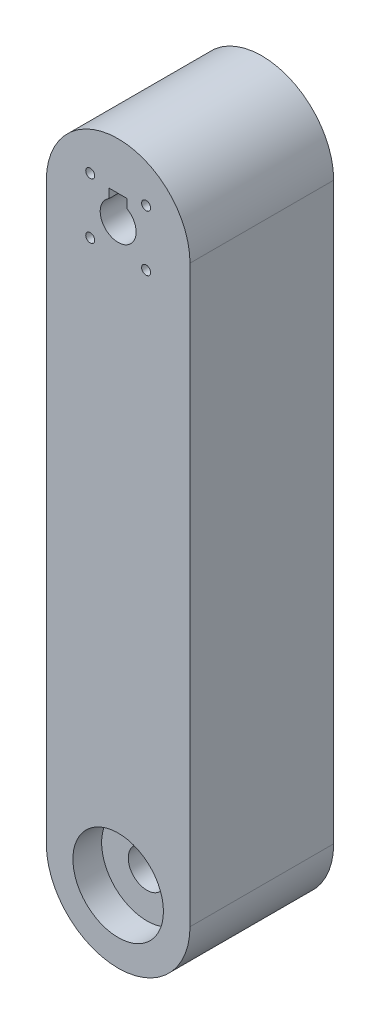
ISO-10303-21;
HEADER;
FILE_DESCRIPTION(('STEP AP214'),'2;1');
FILE_NAME('part.step','',(''),(''),'','','');
FILE_SCHEMA(('AUTOMOTIVE_DESIGN { 1 0 10303 214 1 1 1 1 }'));
ENDSEC;
DATA;
#1=APPLICATION_CONTEXT('core data for automotive mechanical design processes');
#2=APPLICATION_PROTOCOL_DEFINITION('international standard','automotive_design',2000,#1);
#3=PRODUCT_CONTEXT('',#1,'mechanical');
#4=PRODUCT('Part','Part','',(#3));
#5=PRODUCT_RELATED_PRODUCT_CATEGORY('part','',(#4));
#6=PRODUCT_DEFINITION_FORMATION('','',#4);
#7=PRODUCT_DEFINITION_CONTEXT('part definition',#1,'design');
#8=PRODUCT_DEFINITION('design','',#6,#7);
#9=PRODUCT_DEFINITION_SHAPE('','',#8);
#10=(LENGTH_UNIT() NAMED_UNIT(*) SI_UNIT(.MILLI.,.METRE.));
#11=(NAMED_UNIT(*) PLANE_ANGLE_UNIT() SI_UNIT($,.RADIAN.));
#12=(NAMED_UNIT(*) SI_UNIT($,.STERADIAN.) SOLID_ANGLE_UNIT());
#13=UNCERTAINTY_MEASURE_WITH_UNIT(LENGTH_MEASURE(1.E-05),#10,'distance_accuracy_value','');
#14=(GEOMETRIC_REPRESENTATION_CONTEXT(3) GLOBAL_UNCERTAINTY_ASSIGNED_CONTEXT((#13)) GLOBAL_UNIT_ASSIGNED_CONTEXT((#10,
#11,#12)) REPRESENTATION_CONTEXT('',''));
#15=CARTESIAN_POINT('',(0.,0.,0.));
#16=DIRECTION('',(0.,0.,1.));
#17=DIRECTION('',(1.,0.,0.));
#18=AXIS2_PLACEMENT_3D('',#15,#16,#17);
#19=CARTESIAN_POINT('',(0.,-50.8,25.4));
#20=DIRECTION('',(0.,0.,-1.));
#21=DIRECTION('',(-1.,0.,0.));
#22=AXIS2_PLACEMENT_3D('',#19,#20,#21);
#23=CYLINDRICAL_SURFACE('',#22,12.7);
#24=CARTESIAN_POINT('',(0.,-50.8,0.));
#25=DIRECTION('',(0.,0.,1.));
#26=DIRECTION('',(1.,0.,0.));
#27=AXIS2_PLACEMENT_3D('',#24,#25,#26);
#28=CIRCLE('',#27,12.7);
#29=CARTESIAN_POINT('',(-12.7,-50.8,0.));
#30=VERTEX_POINT('',#29);
#31=CARTESIAN_POINT('',(12.7,-50.8,0.));
#32=VERTEX_POINT('',#31);
#33=EDGE_CURVE('E134',#30,#32,#28,.T.);
#34=ORIENTED_EDGE('',*,*,#33,.T.);
#35=DIRECTION('',(0.,0.,-1.));
#36=VECTOR('',#35,1.);
#37=CARTESIAN_POINT('',(12.7,-50.8,25.4));
#38=LINE('',#37,#36);
#39=CARTESIAN_POINT('',(12.7,-50.8,25.4));
#40=VERTEX_POINT('',#39);
#41=EDGE_CURVE('E11',#40,#32,#38,.T.);
#42=ORIENTED_EDGE('',*,*,#41,.F.);
#43=CARTESIAN_POINT('',(0.,-50.8,25.4));
#44=DIRECTION('',(0.,0.,1.));
#45=DIRECTION('',(1.,0.,0.));
#46=AXIS2_PLACEMENT_3D('',#43,#44,#45);
#47=CIRCLE('',#46,12.7);
#48=CARTESIAN_POINT('',(-12.7,-50.8,25.4));
#49=VERTEX_POINT('',#48);
#50=EDGE_CURVE('E144',#49,#40,#47,.T.);
#51=ORIENTED_EDGE('',*,*,#50,.F.);
#52=DIRECTION('',(0.,0.,-1.));
#53=VECTOR('',#52,1.);
#54=CARTESIAN_POINT('',(-12.7,-50.8,25.4));
#55=LINE('',#54,#53);
#56=EDGE_CURVE('E149',#49,#30,#55,.T.);
#57=ORIENTED_EDGE('',*,*,#56,.T.);
#58=EDGE_LOOP('',(#34,#42,#51,#57));
#59=FACE_BOUND('',#58,.T.);
#60=ADVANCED_FACE('F38',(#59),#23,.T.);
#61=CARTESIAN_POINT('',(12.7,50.8,25.4));
#62=DIRECTION('',(-1.,0.,0.));
#63=DIRECTION('',(0.,-1.,0.));
#64=AXIS2_PLACEMENT_3D('',#61,#62,#63);
#65=PLANE('',#64);
#66=DIRECTION('',(0.,1.,0.));
#67=VECTOR('',#66,1.);
#68=CARTESIAN_POINT('',(12.7,50.8,0.));
#69=LINE('',#68,#67);
#70=CARTESIAN_POINT('',(12.7,50.8,0.));
#71=VERTEX_POINT('',#70);
#72=EDGE_CURVE('E138',#32,#71,#69,.T.);
#73=ORIENTED_EDGE('',*,*,#72,.T.);
#74=DIRECTION('',(0.,0.,-1.));
#75=VECTOR('',#74,1.);
#76=CARTESIAN_POINT('',(12.7,50.8,25.4));
#77=LINE('',#76,#75);
#78=CARTESIAN_POINT('',(12.7,50.8,25.4));
#79=VERTEX_POINT('',#78);
#80=EDGE_CURVE('E46',#79,#71,#77,.T.);
#81=ORIENTED_EDGE('',*,*,#80,.F.);
#82=DIRECTION('',(0.,1.,0.));
#83=VECTOR('',#82,1.);
#84=CARTESIAN_POINT('',(12.7,50.8,25.4));
#85=LINE('',#84,#83);
#86=EDGE_CURVE('E90',#40,#79,#85,.T.);
#87=ORIENTED_EDGE('',*,*,#86,.F.);
#88=ORIENTED_EDGE('',*,*,#41,.T.);
#89=EDGE_LOOP('',(#73,#81,#87,#88));
#90=FACE_BOUND('',#89,.T.);
#91=ADVANCED_FACE('F178',(#90),#65,.F.);
#92=CARTESIAN_POINT('',(0.,50.8,25.4));
#93=DIRECTION('',(0.,0.,-1.));
#94=DIRECTION('',(-1.,0.,0.));
#95=AXIS2_PLACEMENT_3D('',#92,#93,#94);
#96=CYLINDRICAL_SURFACE('',#95,12.7);
#97=CARTESIAN_POINT('',(0.,50.8,0.));
#98=DIRECTION('',(0.,0.,1.));
#99=DIRECTION('',(-1.,0.,0.));
#100=AXIS2_PLACEMENT_3D('',#97,#98,#99);
#101=CIRCLE('',#100,12.7);
#102=CARTESIAN_POINT('',(-12.7,50.8,0.));
#103=VERTEX_POINT('',#102);
#104=EDGE_CURVE('E152',#71,#103,#101,.T.);
#105=ORIENTED_EDGE('',*,*,#104,.T.);
#106=DIRECTION('',(0.,0.,-1.));
#107=VECTOR('',#106,1.);
#108=CARTESIAN_POINT('',(-12.7,50.8,25.4));
#109=LINE('',#108,#107);
#110=CARTESIAN_POINT('',(-12.7,50.8,25.4));
#111=VERTEX_POINT('',#110);
#112=EDGE_CURVE('E156',#111,#103,#109,.T.);
#113=ORIENTED_EDGE('',*,*,#112,.F.);
#114=CARTESIAN_POINT('',(0.,50.8,25.4));
#115=DIRECTION('',(0.,0.,1.));
#116=DIRECTION('',(-1.,0.,0.));
#117=AXIS2_PLACEMENT_3D('',#114,#115,#116);
#118=CIRCLE('',#117,12.7);
#119=EDGE_CURVE('E147',#79,#111,#118,.T.);
#120=ORIENTED_EDGE('',*,*,#119,.F.);
#121=ORIENTED_EDGE('',*,*,#80,.T.);
#122=EDGE_LOOP('',(#105,#113,#120,#121));
#123=FACE_BOUND('',#122,.T.);
#124=ADVANCED_FACE('F162',(#123),#96,.T.);
#125=CARTESIAN_POINT('',(-12.7,50.8,25.4));
#126=DIRECTION('',(1.,0.,0.));
#127=DIRECTION('',(0.,1.,0.));
#128=AXIS2_PLACEMENT_3D('',#125,#126,#127);
#129=PLANE('',#128);
#130=DIRECTION('',(0.,-1.,0.));
#131=VECTOR('',#130,1.);
#132=CARTESIAN_POINT('',(-12.7,50.8,0.));
#133=LINE('',#132,#131);
#134=EDGE_CURVE('E83',#103,#30,#133,.T.);
#135=ORIENTED_EDGE('',*,*,#134,.T.);
#136=ORIENTED_EDGE('',*,*,#56,.F.);
#137=DIRECTION('',(0.,-1.,0.));
#138=VECTOR('',#137,1.);
#139=CARTESIAN_POINT('',(-12.7,50.8,25.4));
#140=LINE('',#139,#138);
#141=EDGE_CURVE('E62',#111,#49,#140,.T.);
#142=ORIENTED_EDGE('',*,*,#141,.F.);
#143=ORIENTED_EDGE('',*,*,#112,.T.);
#144=EDGE_LOOP('',(#135,#136,#142,#143));
#145=FACE_BOUND('',#144,.T.);
#146=ADVANCED_FACE('F168',(#145),#129,.F.);
#147=CARTESIAN_POINT('',(0.,-50.8,25.4));
#148=DIRECTION('',(0.,0.,1.));
#149=DIRECTION('',(1.,0.,0.));
#150=AXIS2_PLACEMENT_3D('',#147,#148,#149);
#151=PLANE('',#150);
#152=CARTESIAN_POINT('',(0.,-50.8,25.4));
#153=DIRECTION('',(0.,0.,1.));
#154=DIRECTION('',(1.,0.,0.));
#155=AXIS2_PLACEMENT_3D('',#152,#153,#154);
#156=CIRCLE('',#155,8.001);
#157=CARTESIAN_POINT('',(8.001,-50.8,25.4));
#158=VERTEX_POINT('',#157);
#159=EDGE_CURVE('E351',#158,#158,#156,.T.);
#160=ORIENTED_EDGE('',*,*,#159,.F.);
#161=EDGE_LOOP('',(#160));
#162=FACE_BOUND('',#161,.T.);
#163=DIRECTION('',(0.,-1.,0.));
#164=VECTOR('',#163,1.);
#165=CARTESIAN_POINT('',(-1.5875,55.1371306570156,25.4));
#166=LINE('',#165,#164);
#167=CARTESIAN_POINT('',(-1.5875,55.1371306570156,25.4));
#168=VERTEX_POINT('',#167);
#169=CARTESIAN_POINT('',(-1.5875,53.5496306570156,25.4));
#170=VERTEX_POINT('',#169);
#171=EDGE_CURVE('E53',#168,#170,#166,.T.);
#172=ORIENTED_EDGE('',*,*,#171,.F.);
#173=DIRECTION('',(-1.,0.,0.));
#174=VECTOR('',#173,1.);
#175=CARTESIAN_POINT('',(-1.5875,55.1371306570156,25.4));
#176=LINE('',#175,#174);
#177=CARTESIAN_POINT('',(1.5875,55.1371306570156,25.4));
#178=VERTEX_POINT('',#177);
#179=EDGE_CURVE('E130',#178,#168,#176,.T.);
#180=ORIENTED_EDGE('',*,*,#179,.F.);
#181=DIRECTION('',(0.,1.,0.));
#182=VECTOR('',#181,1.);
#183=CARTESIAN_POINT('',(1.5875,55.1371306570156,25.4));
#184=LINE('',#183,#182);
#185=CARTESIAN_POINT('',(1.5875,53.5496306570156,25.4));
#186=VERTEX_POINT('',#185);
#187=EDGE_CURVE('E362',#186,#178,#184,.T.);
#188=ORIENTED_EDGE('',*,*,#187,.F.);
#189=CARTESIAN_POINT('',(0.,50.8,25.4));
#190=DIRECTION('',(0.,0.,1.));
#191=DIRECTION('',(1.,0.,0.));
#192=AXIS2_PLACEMENT_3D('',#189,#190,#191);
#193=CIRCLE('',#192,3.175);
#194=EDGE_CURVE('E135',#170,#186,#193,.T.);
#195=ORIENTED_EDGE('',*,*,#194,.F.);
#196=EDGE_LOOP('',(#172,#180,#188,#195));
#197=FACE_BOUND('',#196,.T.);
#198=CARTESIAN_POINT('',(4.93914086658801,45.8608591334119,25.4));
#199=DIRECTION('',(0.,0.,1.));
#200=DIRECTION('',(1.,0.,0.));
#201=AXIS2_PLACEMENT_3D('',#198,#199,#200);
#202=CIRCLE('',#201,0.79375);
#203=CARTESIAN_POINT('',(5.73289086658801,45.8608591334119,25.4));
#204=VERTEX_POINT('',#203);
#205=EDGE_CURVE('E369',#204,#204,#202,.T.);
#206=ORIENTED_EDGE('',*,*,#205,.F.);
#207=EDGE_LOOP('',(#206));
#208=FACE_BOUND('',#207,.T.);
#209=CARTESIAN_POINT('',(4.93914086658806,55.739140866588,25.4));
#210=DIRECTION('',(0.,0.,1.));
#211=DIRECTION('',(1.,0.,0.));
#212=AXIS2_PLACEMENT_3D('',#209,#210,#211);
#213=CIRCLE('',#212,0.79375);
#214=CARTESIAN_POINT('',(5.73289086658806,55.739140866588,25.4));
#215=VERTEX_POINT('',#214);
#216=EDGE_CURVE('E385',#215,#215,#213,.T.);
#217=ORIENTED_EDGE('',*,*,#216,.F.);
#218=EDGE_LOOP('',(#217));
#219=FACE_BOUND('',#218,.T.);
#220=CARTESIAN_POINT('',(-4.93914086658805,45.860859133412,25.4));
#221=DIRECTION('',(0.,0.,1.));
#222=DIRECTION('',(1.,0.,0.));
#223=AXIS2_PLACEMENT_3D('',#220,#221,#222);
#224=CIRCLE('',#223,0.793749999999997);
#225=CARTESIAN_POINT('',(-4.14539086658806,45.860859133412,25.4));
#226=VERTEX_POINT('',#225);
#227=EDGE_CURVE('E379',#226,#226,#224,.T.);
#228=ORIENTED_EDGE('',*,*,#227,.F.);
#229=EDGE_LOOP('',(#228));
#230=FACE_BOUND('',#229,.T.);
#231=CARTESIAN_POINT('',(-4.93914086658801,55.7391408665881,25.4));
#232=DIRECTION('',(0.,0.,1.));
#233=DIRECTION('',(1.,0.,0.));
#234=AXIS2_PLACEMENT_3D('',#231,#232,#233);
#235=CIRCLE('',#234,0.793750000000002);
#236=CARTESIAN_POINT('',(-4.14539086658801,55.7391408665881,25.4));
#237=VERTEX_POINT('',#236);
#238=EDGE_CURVE('E373',#237,#237,#235,.T.);
#239=ORIENTED_EDGE('',*,*,#238,.F.);
#240=EDGE_LOOP('',(#239));
#241=FACE_BOUND('',#240,.T.);
#242=ORIENTED_EDGE('',*,*,#50,.T.);
#243=ORIENTED_EDGE('',*,*,#86,.T.);
#244=ORIENTED_EDGE('',*,*,#119,.T.);
#245=ORIENTED_EDGE('',*,*,#141,.T.);
#246=EDGE_LOOP('',(#242,#243,#244,#245));
#247=FACE_BOUND('',#246,.T.);
#248=ADVANCED_FACE('F170',(#162,#197,#208,#219,#230,#241,#247),#151,.T.);
#249=CARTESIAN_POINT('',(0.,-50.8,0.));
#250=DIRECTION('',(0.,0.,1.));
#251=DIRECTION('',(1.,0.,0.));
#252=AXIS2_PLACEMENT_3D('',#249,#250,#251);
#253=PLANE('',#252);
#254=CARTESIAN_POINT('',(0.,-50.8,0.));
#255=DIRECTION('',(0.,0.,1.));
#256=DIRECTION('',(1.,0.,0.));
#257=AXIS2_PLACEMENT_3D('',#254,#255,#256);
#258=CIRCLE('',#257,8.001);
#259=CARTESIAN_POINT('',(8.001,-50.8,0.));
#260=VERTEX_POINT('',#259);
#261=EDGE_CURVE('E346',#260,#260,#258,.T.);
#262=ORIENTED_EDGE('',*,*,#261,.T.);
#263=EDGE_LOOP('',(#262));
#264=FACE_BOUND('',#263,.T.);
#265=CARTESIAN_POINT('',(4.93914086658801,45.8608591334119,0.));
#266=DIRECTION('',(0.,0.,1.));
#267=DIRECTION('',(1.,0.,0.));
#268=AXIS2_PLACEMENT_3D('',#265,#266,#267);
#269=CIRCLE('',#268,0.79375);
#270=CARTESIAN_POINT('',(5.73289086658801,45.8608591334119,0.));
#271=VERTEX_POINT('',#270);
#272=EDGE_CURVE('E388',#271,#271,#269,.F.);
#273=ORIENTED_EDGE('',*,*,#272,.F.);
#274=EDGE_LOOP('',(#273));
#275=FACE_BOUND('',#274,.T.);
#276=CARTESIAN_POINT('',(4.93914086658806,55.739140866588,0.));
#277=DIRECTION('',(0.,0.,1.));
#278=DIRECTION('',(1.,0.,0.));
#279=AXIS2_PLACEMENT_3D('',#276,#277,#278);
#280=CIRCLE('',#279,0.79375);
#281=CARTESIAN_POINT('',(5.73289086658806,55.739140866588,0.));
#282=VERTEX_POINT('',#281);
#283=EDGE_CURVE('E382',#282,#282,#280,.F.);
#284=ORIENTED_EDGE('',*,*,#283,.F.);
#285=EDGE_LOOP('',(#284));
#286=FACE_BOUND('',#285,.T.);
#287=CARTESIAN_POINT('',(-4.93914086658805,45.860859133412,0.));
#288=DIRECTION('',(0.,0.,1.));
#289=DIRECTION('',(1.,0.,0.));
#290=AXIS2_PLACEMENT_3D('',#287,#288,#289);
#291=CIRCLE('',#290,0.793749999999997);
#292=CARTESIAN_POINT('',(-4.14539086658806,45.860859133412,0.));
#293=VERTEX_POINT('',#292);
#294=EDGE_CURVE('E376',#293,#293,#291,.F.);
#295=ORIENTED_EDGE('',*,*,#294,.F.);
#296=EDGE_LOOP('',(#295));
#297=FACE_BOUND('',#296,.T.);
#298=CARTESIAN_POINT('',(-4.93914086658801,55.7391408665881,0.));
#299=DIRECTION('',(0.,0.,1.));
#300=DIRECTION('',(1.,0.,0.));
#301=AXIS2_PLACEMENT_3D('',#298,#299,#300);
#302=CIRCLE('',#301,0.793750000000002);
#303=CARTESIAN_POINT('',(-4.14539086658801,55.7391408665881,0.));
#304=VERTEX_POINT('',#303);
#305=EDGE_CURVE('E140',#304,#304,#302,.F.);
#306=ORIENTED_EDGE('',*,*,#305,.F.);
#307=EDGE_LOOP('',(#306));
#308=FACE_BOUND('',#307,.T.);
#309=DIRECTION('',(-1.,0.,0.));
#310=VECTOR('',#309,1.);
#311=CARTESIAN_POINT('',(-1.5875,55.1371306570156,0.));
#312=LINE('',#311,#310);
#313=CARTESIAN_POINT('',(1.5875,55.1371306570156,0.));
#314=VERTEX_POINT('',#313);
#315=CARTESIAN_POINT('',(-1.5875,55.1371306570156,0.));
#316=VERTEX_POINT('',#315);
#317=EDGE_CURVE('E120',#314,#316,#312,.T.);
#318=ORIENTED_EDGE('',*,*,#317,.T.);
#319=DIRECTION('',(0.,-1.,0.));
#320=VECTOR('',#319,1.);
#321=CARTESIAN_POINT('',(-1.5875,55.1371306570156,0.));
#322=LINE('',#321,#320);
#323=CARTESIAN_POINT('',(-1.5875,53.5496306570156,0.));
#324=VERTEX_POINT('',#323);
#325=EDGE_CURVE('E113',#316,#324,#322,.T.);
#326=ORIENTED_EDGE('',*,*,#325,.T.);
#327=CARTESIAN_POINT('',(0.,50.8,0.));
#328=DIRECTION('',(0.,0.,1.));
#329=DIRECTION('',(1.,0.,0.));
#330=AXIS2_PLACEMENT_3D('',#327,#328,#329);
#331=CIRCLE('',#330,3.175);
#332=CARTESIAN_POINT('',(1.5875,53.5496306570156,0.));
#333=VERTEX_POINT('',#332);
#334=EDGE_CURVE('E127',#333,#324,#331,.F.);
#335=ORIENTED_EDGE('',*,*,#334,.F.);
#336=DIRECTION('',(0.,1.,0.));
#337=VECTOR('',#336,1.);
#338=CARTESIAN_POINT('',(1.5875,55.1371306570156,0.));
#339=LINE('',#338,#337);
#340=EDGE_CURVE('E129',#333,#314,#339,.T.);
#341=ORIENTED_EDGE('',*,*,#340,.T.);
#342=EDGE_LOOP('',(#318,#326,#335,#341));
#343=FACE_BOUND('',#342,.T.);
#344=ORIENTED_EDGE('',*,*,#33,.F.);
#345=ORIENTED_EDGE('',*,*,#134,.F.);
#346=ORIENTED_EDGE('',*,*,#104,.F.);
#347=ORIENTED_EDGE('',*,*,#72,.F.);
#348=EDGE_LOOP('',(#344,#345,#346,#347));
#349=FACE_BOUND('',#348,.T.);
#350=ADVANCED_FACE('F124',(#264,#275,#286,#297,#308,#343,#349),#253,.F.);
#351=CARTESIAN_POINT('',(0.,50.8,-0.001000000000001));
#352=DIRECTION('',(0.,0.,1.));
#353=DIRECTION('',(1.,0.,0.));
#354=AXIS2_PLACEMENT_3D('',#351,#352,#353);
#355=CYLINDRICAL_SURFACE('',#354,3.175);
#356=ORIENTED_EDGE('',*,*,#194,.T.);
#357=DIRECTION('',(0.,0.,1.));
#358=VECTOR('',#357,1.);
#359=CARTESIAN_POINT('',(1.5875,53.5496306570156,0.));
#360=LINE('',#359,#358);
#361=EDGE_CURVE('E119',#333,#186,#360,.T.);
#362=ORIENTED_EDGE('',*,*,#361,.F.);
#363=ORIENTED_EDGE('',*,*,#334,.T.);
#364=DIRECTION('',(0.,0.,1.));
#365=VECTOR('',#364,1.);
#366=CARTESIAN_POINT('',(-1.5875,53.5496306570156,0.));
#367=LINE('',#366,#365);
#368=EDGE_CURVE('E110',#324,#170,#367,.T.);
#369=ORIENTED_EDGE('',*,*,#368,.T.);
#370=EDGE_LOOP('',(#356,#362,#363,#369));
#371=FACE_BOUND('',#370,.T.);
#372=ADVANCED_FACE('F133',(#371),#355,.F.);
#373=CARTESIAN_POINT('',(-4.93914086658801,55.7391408665881,-0.001000000000001));
#374=DIRECTION('',(0.,0.,1.));
#375=DIRECTION('',(1.,0.,0.));
#376=AXIS2_PLACEMENT_3D('',#373,#374,#375);
#377=CYLINDRICAL_SURFACE('',#376,0.793750000000002);
#378=ORIENTED_EDGE('',*,*,#238,.T.);
#379=EDGE_LOOP('',(#378));
#380=FACE_BOUND('',#379,.T.);
#381=ORIENTED_EDGE('',*,*,#305,.T.);
#382=EDGE_LOOP('',(#381));
#383=FACE_BOUND('',#382,.T.);
#384=ADVANCED_FACE('F201',(#380,#383),#377,.F.);
#385=CARTESIAN_POINT('',(-4.93914086658805,45.860859133412,-0.001000000000001));
#386=DIRECTION('',(0.,0.,1.));
#387=DIRECTION('',(1.,0.,0.));
#388=AXIS2_PLACEMENT_3D('',#385,#386,#387);
#389=CYLINDRICAL_SURFACE('',#388,0.793749999999997);
#390=ORIENTED_EDGE('',*,*,#227,.T.);
#391=EDGE_LOOP('',(#390));
#392=FACE_BOUND('',#391,.T.);
#393=ORIENTED_EDGE('',*,*,#294,.T.);
#394=EDGE_LOOP('',(#393));
#395=FACE_BOUND('',#394,.T.);
#396=ADVANCED_FACE('F206',(#392,#395),#389,.F.);
#397=CARTESIAN_POINT('',(4.93914086658806,55.739140866588,-0.001000000000001));
#398=DIRECTION('',(0.,0.,1.));
#399=DIRECTION('',(1.,0.,0.));
#400=AXIS2_PLACEMENT_3D('',#397,#398,#399);
#401=CYLINDRICAL_SURFACE('',#400,0.79375);
#402=ORIENTED_EDGE('',*,*,#216,.T.);
#403=EDGE_LOOP('',(#402));
#404=FACE_BOUND('',#403,.T.);
#405=ORIENTED_EDGE('',*,*,#283,.T.);
#406=EDGE_LOOP('',(#405));
#407=FACE_BOUND('',#406,.T.);
#408=ADVANCED_FACE('F218',(#404,#407),#401,.F.);
#409=CARTESIAN_POINT('',(4.93914086658801,45.8608591334119,-0.001000000000001));
#410=DIRECTION('',(0.,0.,1.));
#411=DIRECTION('',(1.,0.,0.));
#412=AXIS2_PLACEMENT_3D('',#409,#410,#411);
#413=CYLINDRICAL_SURFACE('',#412,0.79375);
#414=ORIENTED_EDGE('',*,*,#205,.T.);
#415=EDGE_LOOP('',(#414));
#416=FACE_BOUND('',#415,.T.);
#417=ORIENTED_EDGE('',*,*,#272,.T.);
#418=EDGE_LOOP('',(#417));
#419=FACE_BOUND('',#418,.T.);
#420=ADVANCED_FACE('F228',(#416,#419),#413,.F.);
#421=CARTESIAN_POINT('',(-1.5875,55.1371306570156,0.));
#422=DIRECTION('',(-1.,0.,0.));
#423=DIRECTION('',(0.,0.,1.));
#424=AXIS2_PLACEMENT_3D('',#421,#422,#423);
#425=PLANE('',#424);
#426=ORIENTED_EDGE('',*,*,#171,.T.);
#427=ORIENTED_EDGE('',*,*,#368,.F.);
#428=ORIENTED_EDGE('',*,*,#325,.F.);
#429=DIRECTION('',(0.,0.,1.));
#430=VECTOR('',#429,1.);
#431=CARTESIAN_POINT('',(-1.5875,55.1371306570156,0.));
#432=LINE('',#431,#430);
#433=EDGE_CURVE('E367',#316,#168,#432,.T.);
#434=ORIENTED_EDGE('',*,*,#433,.T.);
#435=EDGE_LOOP('',(#426,#427,#428,#434));
#436=FACE_BOUND('',#435,.T.);
#437=ADVANCED_FACE('F112',(#436),#425,.F.);
#438=CARTESIAN_POINT('',(-1.5875,55.1371306570156,0.));
#439=DIRECTION('',(0.,1.,0.));
#440=DIRECTION('',(0.,0.,1.));
#441=AXIS2_PLACEMENT_3D('',#438,#439,#440);
#442=PLANE('',#441);
#443=ORIENTED_EDGE('',*,*,#179,.T.);
#444=ORIENTED_EDGE('',*,*,#433,.F.);
#445=ORIENTED_EDGE('',*,*,#317,.F.);
#446=DIRECTION('',(0.,0.,1.));
#447=VECTOR('',#446,1.);
#448=CARTESIAN_POINT('',(1.5875,55.1371306570156,0.));
#449=LINE('',#448,#447);
#450=EDGE_CURVE('E370',#314,#178,#449,.T.);
#451=ORIENTED_EDGE('',*,*,#450,.T.);
#452=EDGE_LOOP('',(#443,#444,#445,#451));
#453=FACE_BOUND('',#452,.T.);
#454=ADVANCED_FACE('F255',(#453),#442,.F.);
#455=CARTESIAN_POINT('',(1.5875,55.1371306570156,0.));
#456=DIRECTION('',(1.,0.,0.));
#457=DIRECTION('',(0.,1.,0.));
#458=AXIS2_PLACEMENT_3D('',#455,#456,#457);
#459=PLANE('',#458);
#460=ORIENTED_EDGE('',*,*,#187,.T.);
#461=ORIENTED_EDGE('',*,*,#450,.F.);
#462=ORIENTED_EDGE('',*,*,#340,.F.);
#463=ORIENTED_EDGE('',*,*,#361,.T.);
#464=EDGE_LOOP('',(#460,#461,#462,#463));
#465=FACE_BOUND('',#464,.T.);
#466=ADVANCED_FACE('F264',(#465),#459,.F.);
#467=CARTESIAN_POINT('',(0.,-50.8,20.32));
#468=DIRECTION('',(0.,0.,1.));
#469=DIRECTION('',(1.,0.,0.));
#470=AXIS2_PLACEMENT_3D('',#467,#468,#469);
#471=CYLINDRICAL_SURFACE('',#470,8.001);
#472=CARTESIAN_POINT('',(0.,-50.8,20.32));
#473=DIRECTION('',(0.,0.,1.));
#474=DIRECTION('',(1.,0.,0.));
#475=AXIS2_PLACEMENT_3D('',#472,#473,#474);
#476=CIRCLE('',#475,8.001);
#477=CARTESIAN_POINT('',(8.001,-50.8,20.32));
#478=VERTEX_POINT('',#477);
#479=EDGE_CURVE('E354',#478,#478,#476,.T.);
#480=ORIENTED_EDGE('',*,*,#479,.F.);
#481=EDGE_LOOP('',(#480));
#482=FACE_BOUND('',#481,.T.);
#483=ORIENTED_EDGE('',*,*,#159,.T.);
#484=EDGE_LOOP('',(#483));
#485=FACE_BOUND('',#484,.T.);
#486=ADVANCED_FACE('F274',(#482,#485),#471,.F.);
#487=CARTESIAN_POINT('',(0.,-50.8,20.32));
#488=DIRECTION('',(0.,0.,1.));
#489=DIRECTION('',(1.,0.,0.));
#490=AXIS2_PLACEMENT_3D('',#487,#488,#489);
#491=PLANE('',#490);
#492=CARTESIAN_POINT('',(0.,-50.8,20.32));
#493=DIRECTION('',(0.,0.,1.));
#494=DIRECTION('',(1.,0.,0.));
#495=AXIS2_PLACEMENT_3D('',#492,#493,#494);
#496=CIRCLE('',#495,3.302);
#497=CARTESIAN_POINT('',(3.302,-50.8,20.32));
#498=VERTEX_POINT('',#497);
#499=EDGE_CURVE('E344',#498,#498,#496,.T.);
#500=ORIENTED_EDGE('',*,*,#499,.F.);
#501=EDGE_LOOP('',(#500));
#502=FACE_BOUND('',#501,.T.);
#503=ORIENTED_EDGE('',*,*,#479,.T.);
#504=EDGE_LOOP('',(#503));
#505=FACE_BOUND('',#504,.T.);
#506=ADVANCED_FACE('F289',(#502,#505),#491,.T.);
#507=CARTESIAN_POINT('',(0.,-50.8,5.08));
#508=DIRECTION('',(0.,0.,-1.));
#509=DIRECTION('',(-1.,0.,0.));
#510=AXIS2_PLACEMENT_3D('',#507,#508,#509);
#511=CYLINDRICAL_SURFACE('',#510,8.001);
#512=CARTESIAN_POINT('',(0.,-50.8,5.08));
#513=DIRECTION('',(0.,0.,1.));
#514=DIRECTION('',(1.,0.,0.));
#515=AXIS2_PLACEMENT_3D('',#512,#513,#514);
#516=CIRCLE('',#515,8.001);
#517=CARTESIAN_POINT('',(8.001,-50.8,5.08));
#518=VERTEX_POINT('',#517);
#519=EDGE_CURVE('E348',#518,#518,#516,.T.);
#520=ORIENTED_EDGE('',*,*,#519,.T.);
#521=EDGE_LOOP('',(#520));
#522=FACE_BOUND('',#521,.T.);
#523=ORIENTED_EDGE('',*,*,#261,.F.);
#524=EDGE_LOOP('',(#523));
#525=FACE_BOUND('',#524,.T.);
#526=ADVANCED_FACE('F303',(#522,#525),#511,.F.);
#527=CARTESIAN_POINT('',(0.,-50.8,5.08));
#528=DIRECTION('',(0.,0.,-1.));
#529=DIRECTION('',(1.,0.,0.));
#530=AXIS2_PLACEMENT_3D('',#527,#528,#529);
#531=PLANE('',#530);
#532=CARTESIAN_POINT('',(0.,-50.8,5.08));
#533=DIRECTION('',(0.,0.,-1.));
#534=DIRECTION('',(-1.,0.,0.));
#535=AXIS2_PLACEMENT_3D('',#532,#533,#534);
#536=CIRCLE('',#535,3.302);
#537=CARTESIAN_POINT('',(-3.302,-50.8,5.08));
#538=VERTEX_POINT('',#537);
#539=EDGE_CURVE('E41',#538,#538,#536,.T.);
#540=ORIENTED_EDGE('',*,*,#539,.F.);
#541=EDGE_LOOP('',(#540));
#542=FACE_BOUND('',#541,.T.);
#543=ORIENTED_EDGE('',*,*,#519,.F.);
#544=EDGE_LOOP('',(#543));
#545=FACE_BOUND('',#544,.T.);
#546=ADVANCED_FACE('F308',(#542,#545),#531,.T.);
#547=CARTESIAN_POINT('',(0.,-50.8,0.));
#548=DIRECTION('',(0.,0.,1.));
#549=DIRECTION('',(1.,0.,0.));
#550=AXIS2_PLACEMENT_3D('',#547,#548,#549);
#551=CYLINDRICAL_SURFACE('',#550,3.302);
#552=ORIENTED_EDGE('',*,*,#539,.T.);
#553=EDGE_LOOP('',(#552));
#554=FACE_BOUND('',#553,.T.);
#555=ORIENTED_EDGE('',*,*,#499,.T.);
#556=EDGE_LOOP('',(#555));
#557=FACE_BOUND('',#556,.T.);
#558=ADVANCED_FACE('F325',(#554,#557),#551,.F.);
#559=CLOSED_SHELL('',(#60,#91,#124,#146,#248,#350,#372,#384,#396,#408,#420,#437,#454,#466,#486,
#506,#526,#546,#558));
#560=MANIFOLD_SOLID_BREP('B2',#559);
#561=ADVANCED_BREP_SHAPE_REPRESENTATION('',(#18,#560),#14);
#562=SHAPE_DEFINITION_REPRESENTATION(#9,#561);
ENDSEC;
END-ISO-10303-21;
